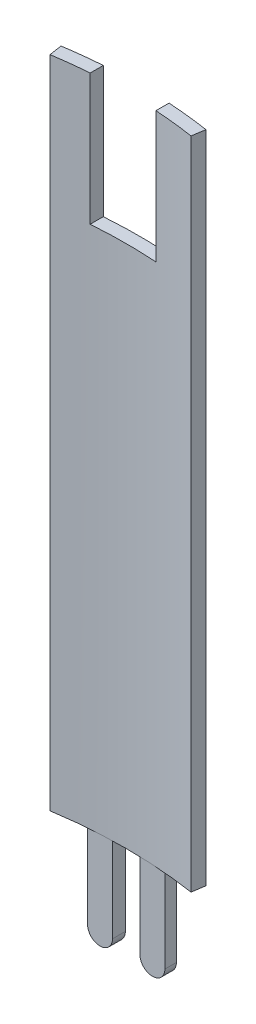
ISO-10303-21;
HEADER;
FILE_DESCRIPTION(('STEP AP214'),'2;1');
FILE_NAME('part.step','',(''),(''),'','','');
FILE_SCHEMA(('AUTOMOTIVE_DESIGN { 1 0 10303 214 1 1 1 1 }'));
ENDSEC;
DATA;
#1=APPLICATION_CONTEXT('core data for automotive mechanical design processes');
#2=APPLICATION_PROTOCOL_DEFINITION('international standard','automotive_design',2000,#1);
#3=PRODUCT_CONTEXT('',#1,'mechanical');
#4=PRODUCT('Part','Part','',(#3));
#5=PRODUCT_RELATED_PRODUCT_CATEGORY('part','',(#4));
#6=PRODUCT_DEFINITION_FORMATION('','',#4);
#7=PRODUCT_DEFINITION_CONTEXT('part definition',#1,'design');
#8=PRODUCT_DEFINITION('design','',#6,#7);
#9=PRODUCT_DEFINITION_SHAPE('','',#8);
#10=(LENGTH_UNIT() NAMED_UNIT(*) SI_UNIT(.MILLI.,.METRE.));
#11=(NAMED_UNIT(*) PLANE_ANGLE_UNIT() SI_UNIT($,.RADIAN.));
#12=(NAMED_UNIT(*) SI_UNIT($,.STERADIAN.) SOLID_ANGLE_UNIT());
#13=UNCERTAINTY_MEASURE_WITH_UNIT(LENGTH_MEASURE(1.E-05),#10,'distance_accuracy_value','');
#14=(GEOMETRIC_REPRESENTATION_CONTEXT(3) GLOBAL_UNCERTAINTY_ASSIGNED_CONTEXT((#13)) GLOBAL_UNIT_ASSIGNED_CONTEXT((#10,
#11,#12)) REPRESENTATION_CONTEXT('',''));
#15=CARTESIAN_POINT('',(0.,0.,0.));
#16=DIRECTION('',(0.,0.,1.));
#17=DIRECTION('',(1.,0.,0.));
#18=AXIS2_PLACEMENT_3D('',#15,#16,#17);
#19=CARTESIAN_POINT('',(0.,127.,0.));
#20=DIRECTION('',(0.,-1.,0.));
#21=DIRECTION('',(0.,0.,-1.));
#22=AXIS2_PLACEMENT_3D('',#19,#20,#21);
#23=PLANE('',#22);
#24=CARTESIAN_POINT('',(0.,127.,0.));
#25=DIRECTION('',(0.,-1.,0.));
#26=DIRECTION('',(0.,0.,-1.));
#27=AXIS2_PLACEMENT_3D('',#24,#25,#26);
#28=CIRCLE('',#27,89.535);
#29=CARTESIAN_POINT('',(-13.716,127.,-88.4781756649627));
#30=VERTEX_POINT('',#29);
#31=CARTESIAN_POINT('',(-6.73910638297873,127.,-89.2810207723842));
#32=VERTEX_POINT('',#31);
#33=EDGE_CURVE('E257',#30,#32,#28,.T.);
#34=ORIENTED_EDGE('',*,*,#33,.T.);
#35=DIRECTION('',(0.,0.,1.));
#36=VECTOR('',#35,1.);
#37=CARTESIAN_POINT('',(-6.73910638297873,127.,-92.076));
#38=LINE('',#37,#36);
#39=CARTESIAN_POINT('',(-6.73910638297873,127.,-91.8280462068038));
#40=VERTEX_POINT('',#39);
#41=EDGE_CURVE('E181',#40,#32,#38,.T.);
#42=ORIENTED_EDGE('',*,*,#41,.F.);
#43=CARTESIAN_POINT('',(0.,127.,0.));
#44=DIRECTION('',(0.,1.,0.));
#45=DIRECTION('',(0.,0.,-1.));
#46=AXIS2_PLACEMENT_3D('',#43,#44,#45);
#47=CIRCLE('',#46,92.075);
#48=CARTESIAN_POINT('',(-14.1051063829787,127.,-90.9881948327631));
#49=VERTEX_POINT('',#48);
#50=EDGE_CURVE('E378',#40,#49,#47,.T.);
#51=ORIENTED_EDGE('',*,*,#50,.T.);
#52=DIRECTION('',(0.153191489361703,0.,0.988196522756047));
#53=VECTOR('',#52,1.);
#54=CARTESIAN_POINT('',(-14.1051063829787,127.,-90.9881948327631));
#55=LINE('',#54,#53);
#56=EDGE_CURVE('E319',#49,#30,#55,.T.);
#57=ORIENTED_EDGE('',*,*,#56,.T.);
#58=EDGE_LOOP('',(#34,#42,#51,#57));
#59=FACE_BOUND('',#58,.T.);
#60=ADVANCED_FACE('F41',(#59),#23,.F.);
#61=CARTESIAN_POINT('',(0.,0.,0.));
#62=DIRECTION('',(0.,-1.,0.));
#63=DIRECTION('',(0.,0.,-1.));
#64=AXIS2_PLACEMENT_3D('',#61,#62,#63);
#65=PLANE('',#64);
#66=CARTESIAN_POINT('',(0.,0.,0.));
#67=DIRECTION('',(0.,1.,0.));
#68=DIRECTION('',(0.,0.,-1.));
#69=AXIS2_PLACEMENT_3D('',#66,#67,#68);
#70=CIRCLE('',#69,92.075);
#71=CARTESIAN_POINT('',(-7.493,0.,-91.7696059488107));
#72=VERTEX_POINT('',#71);
#73=CARTESIAN_POINT('',(-14.1051063829787,0.,-90.9881948327631));
#74=VERTEX_POINT('',#73);
#75=EDGE_CURVE('E287',#72,#74,#70,.T.);
#76=ORIENTED_EDGE('',*,*,#75,.F.);
#77=DIRECTION('',(0.,0.,1.));
#78=VECTOR('',#77,1.);
#79=CARTESIAN_POINT('',(-7.493,0.,0.));
#80=LINE('',#79,#78);
#81=CARTESIAN_POINT('',(-7.493,0.,-89.535));
#82=VERTEX_POINT('',#81);
#83=EDGE_CURVE('E289',#72,#82,#80,.T.);
#84=ORIENTED_EDGE('',*,*,#83,.T.);
#85=DIRECTION('',(-1.,0.,0.));
#86=VECTOR('',#85,1.);
#87=CARTESIAN_POINT('',(0.,0.,-89.535));
#88=LINE('',#87,#86);
#89=CARTESIAN_POINT('',(-2.667,0.,-89.535));
#90=VERTEX_POINT('',#89);
#91=EDGE_CURVE('E11',#90,#82,#88,.T.);
#92=ORIENTED_EDGE('',*,*,#91,.F.);
#93=DIRECTION('',(0.,0.,1.));
#94=VECTOR('',#93,1.);
#95=CARTESIAN_POINT('',(-2.667,0.,0.));
#96=LINE('',#95,#94);
#97=CARTESIAN_POINT('',(-2.667,0.,-92.0363663776444));
#98=VERTEX_POINT('',#97);
#99=EDGE_CURVE('E229',#98,#90,#96,.T.);
#100=ORIENTED_EDGE('',*,*,#99,.F.);
#101=CARTESIAN_POINT('',(2.667,0.,-92.0363663776444));
#102=VERTEX_POINT('',#101);
#103=EDGE_CURVE('E295',#102,#98,#70,.T.);
#104=ORIENTED_EDGE('',*,*,#103,.F.);
#105=DIRECTION('',(0.,0.,1.));
#106=VECTOR('',#105,1.);
#107=CARTESIAN_POINT('',(2.667,0.,0.));
#108=LINE('',#107,#106);
#109=CARTESIAN_POINT('',(2.667,0.,-89.535));
#110=VERTEX_POINT('',#109);
#111=EDGE_CURVE('E50',#102,#110,#108,.T.);
#112=ORIENTED_EDGE('',*,*,#111,.T.);
#113=DIRECTION('',(-1.,0.,0.));
#114=VECTOR('',#113,1.);
#115=CARTESIAN_POINT('',(0.,0.,-89.535));
#116=LINE('',#115,#114);
#117=CARTESIAN_POINT('',(7.493,0.,-89.535));
#118=VERTEX_POINT('',#117);
#119=EDGE_CURVE('E329',#118,#110,#116,.T.);
#120=ORIENTED_EDGE('',*,*,#119,.F.);
#121=DIRECTION('',(0.,0.,1.));
#122=VECTOR('',#121,1.);
#123=CARTESIAN_POINT('',(7.493,0.,0.));
#124=LINE('',#123,#122);
#125=CARTESIAN_POINT('',(7.493,0.,-91.7696059488107));
#126=VERTEX_POINT('',#125);
#127=EDGE_CURVE('E332',#126,#118,#124,.T.);
#128=ORIENTED_EDGE('',*,*,#127,.F.);
#129=CARTESIAN_POINT('',(13.9948928090783,0.,-91.0052119400994));
#130=VERTEX_POINT('',#129);
#131=EDGE_CURVE('E298',#130,#126,#70,.T.);
#132=ORIENTED_EDGE('',*,*,#131,.F.);
#133=DIRECTION('',(0.151994491545787,0.,-0.988381340647292));
#134=VECTOR('',#133,1.);
#135=CARTESIAN_POINT('',(13.608826800552,0.,-88.4947233348553));
#136=LINE('',#135,#134);
#137=CARTESIAN_POINT('',(13.608826800552,0.,-88.4947233348553));
#138=VERTEX_POINT('',#137);
#139=EDGE_CURVE('E296',#138,#130,#136,.T.);
#140=ORIENTED_EDGE('',*,*,#139,.F.);
#141=CARTESIAN_POINT('',(0.,0.,0.));
#142=DIRECTION('',(0.,-1.,0.));
#143=DIRECTION('',(0.,0.,-1.));
#144=AXIS2_PLACEMENT_3D('',#141,#142,#143);
#145=CIRCLE('',#144,89.535);
#146=CARTESIAN_POINT('',(-13.716,0.,-88.4781756649627));
#147=VERTEX_POINT('',#146);
#148=EDGE_CURVE('E253',#147,#138,#145,.T.);
#149=ORIENTED_EDGE('',*,*,#148,.F.);
#150=DIRECTION('',(0.153191489361703,0.,0.988196522756047));
#151=VECTOR('',#150,1.);
#152=CARTESIAN_POINT('',(-14.1051063829787,0.,-90.9881948327631));
#153=LINE('',#152,#151);
#154=EDGE_CURVE('E291',#74,#147,#153,.T.);
#155=ORIENTED_EDGE('',*,*,#154,.F.);
#156=EDGE_LOOP('',(#76,#84,#92,#100,#104,#112,#120,#128,#132,#140,#149,#155));
#157=FACE_BOUND('',#156,.T.);
#158=ADVANCED_FACE('F275',(#157),#65,.T.);
#159=CARTESIAN_POINT('',(0.,127.,0.));
#160=DIRECTION('',(0.,-1.,0.));
#161=DIRECTION('',(0.,0.,-1.));
#162=AXIS2_PLACEMENT_3D('',#159,#160,#161);
#163=CYLINDRICAL_SURFACE('',#162,89.535);
#164=CARTESIAN_POINT('',(0.,101.6,0.));
#165=DIRECTION('',(0.,-1.,0.));
#166=DIRECTION('',(0.,0.,-1.));
#167=AXIS2_PLACEMENT_3D('',#164,#165,#166);
#168=CIRCLE('',#167,89.535);
#169=CARTESIAN_POINT('',(5.96089361702128,101.6,-89.3363530276816));
#170=VERTEX_POINT('',#169);
#171=CARTESIAN_POINT('',(-6.73910638297872,101.6,-89.2810207723842));
#172=VERTEX_POINT('',#171);
#173=EDGE_CURVE('E162',#170,#172,#168,.F.);
#174=ORIENTED_EDGE('',*,*,#173,.T.);
#175=DIRECTION('',(0.,-1.,0.));
#176=VECTOR('',#175,1.);
#177=CARTESIAN_POINT('',(-6.73910638297873,127.,-89.2810207723842));
#178=LINE('',#177,#176);
#179=EDGE_CURVE('E191',#172,#32,#178,.F.);
#180=ORIENTED_EDGE('',*,*,#179,.T.);
#181=ORIENTED_EDGE('',*,*,#33,.F.);
#182=DIRECTION('',(0.,-1.,0.));
#183=VECTOR('',#182,1.);
#184=CARTESIAN_POINT('',(-13.716,127.,-88.4781756649627));
#185=LINE('',#184,#183);
#186=EDGE_CURVE('E315',#30,#147,#185,.T.);
#187=ORIENTED_EDGE('',*,*,#186,.T.);
#188=ORIENTED_EDGE('',*,*,#148,.T.);
#189=DIRECTION('',(0.,-1.,0.));
#190=VECTOR('',#189,1.);
#191=CARTESIAN_POINT('',(13.608826800552,127.,-88.4947233348553));
#192=LINE('',#191,#190);
#193=CARTESIAN_POINT('',(13.608826800552,127.,-88.4947233348553));
#194=VERTEX_POINT('',#193);
#195=EDGE_CURVE('E325',#194,#138,#192,.T.);
#196=ORIENTED_EDGE('',*,*,#195,.F.);
#197=CARTESIAN_POINT('',(5.96089361702127,127.,-89.3363530276816));
#198=VERTEX_POINT('',#197);
#199=EDGE_CURVE('E309',#198,#194,#28,.T.);
#200=ORIENTED_EDGE('',*,*,#199,.F.);
#201=DIRECTION('',(0.,-1.,0.));
#202=VECTOR('',#201,1.);
#203=CARTESIAN_POINT('',(5.96089361702127,127.,-89.3363530276816));
#204=LINE('',#203,#202);
#205=EDGE_CURVE('E57',#198,#170,#204,.T.);
#206=ORIENTED_EDGE('',*,*,#205,.T.);
#207=EDGE_LOOP('',(#174,#180,#181,#187,#188,#196,#200,#206));
#208=FACE_BOUND('',#207,.T.);
#209=ADVANCED_FACE('F43',(#208),#163,.F.);
#210=CARTESIAN_POINT('',(13.608826800552,127.,-88.4947233348553));
#211=DIRECTION('',(-0.988381340647292,0.,-0.151994491545787));
#212=DIRECTION('',(-0.151994491545787,0.,0.988381340647292));
#213=AXIS2_PLACEMENT_3D('',#210,#211,#212);
#214=PLANE('',#213);
#215=ORIENTED_EDGE('',*,*,#139,.T.);
#216=DIRECTION('',(0.,-1.,0.));
#217=VECTOR('',#216,1.);
#218=CARTESIAN_POINT('',(13.9948928090783,127.,-91.0052119400994));
#219=LINE('',#218,#217);
#220=CARTESIAN_POINT('',(13.9948928090783,127.,-91.0052119400994));
#221=VERTEX_POINT('',#220);
#222=EDGE_CURVE('E322',#221,#130,#219,.T.);
#223=ORIENTED_EDGE('',*,*,#222,.F.);
#224=DIRECTION('',(0.151994491545787,0.,-0.988381340647292));
#225=VECTOR('',#224,1.);
#226=CARTESIAN_POINT('',(13.608826800552,127.,-88.4947233348553));
#227=LINE('',#226,#225);
#228=EDGE_CURVE('E379',#194,#221,#227,.T.);
#229=ORIENTED_EDGE('',*,*,#228,.F.);
#230=ORIENTED_EDGE('',*,*,#195,.T.);
#231=EDGE_LOOP('',(#215,#223,#229,#230));
#232=FACE_BOUND('',#231,.T.);
#233=ADVANCED_FACE('F239',(#232),#214,.F.);
#234=CARTESIAN_POINT('',(0.,127.,0.));
#235=DIRECTION('',(0.,-1.,0.));
#236=DIRECTION('',(0.,0.,-1.));
#237=AXIS2_PLACEMENT_3D('',#234,#235,#236);
#238=CYLINDRICAL_SURFACE('',#237,92.075);
#239=ORIENTED_EDGE('',*,*,#50,.F.);
#240=DIRECTION('',(0.,-1.,0.));
#241=VECTOR('',#240,1.);
#242=CARTESIAN_POINT('',(-6.73910638297873,127.,-91.8280462068038));
#243=LINE('',#242,#241);
#244=CARTESIAN_POINT('',(-6.73910638297872,101.6,-91.8280462068038));
#245=VERTEX_POINT('',#244);
#246=EDGE_CURVE('E172',#245,#40,#243,.F.);
#247=ORIENTED_EDGE('',*,*,#246,.F.);
#248=CARTESIAN_POINT('',(0.,101.6,0.));
#249=DIRECTION('',(0.,-1.,0.));
#250=DIRECTION('',(0.,0.,-1.));
#251=AXIS2_PLACEMENT_3D('',#248,#249,#250);
#252=CIRCLE('',#251,92.075);
#253=CARTESIAN_POINT('',(5.96089361702128,101.6,-91.8818446282319));
#254=VERTEX_POINT('',#253);
#255=EDGE_CURVE('E159',#254,#245,#252,.F.);
#256=ORIENTED_EDGE('',*,*,#255,.F.);
#257=DIRECTION('',(0.,-1.,0.));
#258=VECTOR('',#257,1.);
#259=CARTESIAN_POINT('',(5.96089361702127,127.,-91.8818446282319));
#260=LINE('',#259,#258);
#261=CARTESIAN_POINT('',(5.96089361702127,127.,-91.8818446282319));
#262=VERTEX_POINT('',#261);
#263=EDGE_CURVE('E167',#262,#254,#260,.T.);
#264=ORIENTED_EDGE('',*,*,#263,.F.);
#265=EDGE_CURVE('E376',#221,#262,#47,.T.);
#266=ORIENTED_EDGE('',*,*,#265,.F.);
#267=ORIENTED_EDGE('',*,*,#222,.T.);
#268=ORIENTED_EDGE('',*,*,#131,.T.);
#269=DIRECTION('',(0.,-1.,0.));
#270=VECTOR('',#269,1.);
#271=CARTESIAN_POINT('',(7.493,127.,-91.7696059488107));
#272=LINE('',#271,#270);
#273=CARTESIAN_POINT('',(7.493,-16.51,-91.7696059488107));
#274=VERTEX_POINT('',#273);
#275=EDGE_CURVE('E362',#126,#274,#272,.T.);
#276=ORIENTED_EDGE('',*,*,#275,.T.);
#277=CARTESIAN_POINT('',(7.493,-16.51,-91.7696059488107));
#278=CARTESIAN_POINT('',(7.493006626087,-16.5777194077645,-91.7696048483513));
#279=CARTESIAN_POINT('',(7.49014927407407,-16.6454356351868,-91.7698386963676));
#280=CARTESIAN_POINT('',(7.47875787983781,-16.7803820405891,-91.7707680331105));
#281=CARTESIAN_POINT('',(7.47022415768392,-16.8476122457581,-91.7714634958083));
#282=CARTESIAN_POINT('',(7.44754050720196,-16.9810603683064,-91.7733070573561));
#283=CARTESIAN_POINT('',(7.43339515254981,-17.0472790645688,-91.7744547875872));
#284=CARTESIAN_POINT('',(7.39960491193208,-17.178269108345,-91.7771853823897));
#285=CARTESIAN_POINT('',(7.37996008345849,-17.2430404709816,-91.7787682424123));
#286=CARTESIAN_POINT('',(7.31294129536759,-17.4345518806893,-91.784141093818));
#287=CARTESIAN_POINT('',(7.25747239249048,-17.5585514888927,-91.7885562388867));
#288=CARTESIAN_POINT('',(7.12662935629455,-17.7953809024635,-91.7988074798835));
#289=CARTESIAN_POINT('',(7.05125844603452,-17.9082125123841,-91.8046433457189));
#290=CARTESIAN_POINT('',(6.88258527286787,-18.1198399472454,-91.8174427419071));
#291=CARTESIAN_POINT('',(6.78925202100043,-18.2186109947555,-91.8244082177677));
#292=CARTESIAN_POINT('',(6.58737868147916,-18.3991053539727,-91.8391108899842));
#293=CARTESIAN_POINT('',(6.4788361218364,-18.4808258890526,-91.8468482117302));
#294=CARTESIAN_POINT('',(6.24929608540061,-18.6251223605761,-91.8627518381968));
#295=CARTESIAN_POINT('',(6.12826471861179,-18.6876442711509,-91.8709192790857));
#296=CARTESIAN_POINT('',(5.87743122455931,-18.7914680267553,-91.8873071079984));
#297=CARTESIAN_POINT('',(5.74762957508855,-18.832771026709,-91.8955274931158));
#298=CARTESIAN_POINT('',(5.48273898699338,-18.8930325362186,-91.9117120867327));
#299=CARTESIAN_POINT('',(5.34764320606436,-18.9119610735932,-91.9196759377353));
#300=CARTESIAN_POINT('',(5.07615879734381,-18.9268234726386,-91.9350679548108));
#301=CARTESIAN_POINT('',(4.93977014273605,-18.9227568563075,-91.942496109745));
#302=CARTESIAN_POINT('',(4.66966697807484,-18.891735455009,-91.9566099735144));
#303=CARTESIAN_POINT('',(4.53595086535947,-18.8647948359517,-91.9632961389679));
#304=CARTESIAN_POINT('',(4.2749184303451,-18.7887915010812,-91.9757999832422));
#305=CARTESIAN_POINT('',(4.14760203742124,-18.739729029456,-91.9816176716484));
#306=CARTESIAN_POINT('',(3.90318453705352,-18.6209500376191,-91.9923134585833));
#307=CARTESIAN_POINT('',(3.78606891963194,-18.5512634960593,-91.9971929040522));
#308=CARTESIAN_POINT('',(3.56519650648896,-18.3931837380927,-92.0060173849214));
#309=CARTESIAN_POINT('',(3.46143897553128,-18.3047915519633,-92.0099624717594));
#310=CARTESIAN_POINT('',(3.27036743259797,-18.111936980488,-92.0169520881501));
#311=CARTESIAN_POINT('',(3.1830320123195,-18.0074958445106,-92.0199977931593));
#312=CARTESIAN_POINT('',(3.027101383151,-17.7853780806475,-92.0252595302107));
#313=CARTESIAN_POINT('',(2.95851203914186,-17.6676973268446,-92.027475302681));
#314=CARTESIAN_POINT('',(2.84206447972634,-17.4224966046678,-92.031145283399));
#315=CARTESIAN_POINT('',(2.79420758708716,-17.2949760091058,-92.0325994430556));
#316=CARTESIAN_POINT('',(2.72064768126196,-17.0338045538002,-92.0348036230974));
#317=CARTESIAN_POINT('',(2.6949109985892,-16.9001633381246,-92.0355547137898));
#318=CARTESIAN_POINT('',(2.67603970066728,-16.7230229230481,-92.0361040167294));
#319=CARTESIAN_POINT('',(2.67264802910479,-16.6804514388047,-92.0362025469646));
#320=CARTESIAN_POINT('',(2.66813127052844,-16.5952590711743,-92.0363336350541));
#321=CARTESIAN_POINT('',(2.66700243186611,-16.5526383869701,-92.0363663021063));
#322=CARTESIAN_POINT('',(2.667,-16.51,-92.0363663776444));
#323=B_SPLINE_CURVE_WITH_KNOTS('',3,(#277,#278,#279,#280,#281,#282,#283,#284,#285,#286,#287,
#288,#289,#290,#291,#292,#293,#294,#295,#296,#297,#298,#299,#300,#301,#302,#303,#304,#305,#306,
#307,#308,#309,#310,#311,#312,#313,#314,#315,#316,#317,#318,#319,#320,#321,#322),.UNSPECIFIED.,
.F.,.F.,(4,2,2,2,2,2,2,2,2,2,2,2,2,2,2,2,2,2,2,2,2,2,4),(0.,0.203091848510125,0.406172246395432,
0.609087465619882,0.812000563628926,1.21763970045303,1.6232131857185,2.02949274988816,
2.43583842397188,2.84331731152253,3.25077401805689,3.65877592544837,4.06678631403418,
4.47454420522019,4.88229759555853,5.28946117230441,5.69660232895769,6.10320898890269,
6.5099427142072,6.916702386025,7.32284182109663,7.4509191526884,7.5787839631257),.UNSPECIFIED.);
#324=CARTESIAN_POINT('',(2.667,-16.51,-92.0363663776444));
#325=VERTEX_POINT('',#324);
#326=EDGE_CURVE('E243',#274,#325,#323,.T.);
#327=ORIENTED_EDGE('',*,*,#326,.T.);
#328=DIRECTION('',(0.,-1.,0.));
#329=VECTOR('',#328,1.);
#330=CARTESIAN_POINT('',(2.667,127.,-92.0363663776444));
#331=LINE('',#330,#329);
#332=EDGE_CURVE('E254',#102,#325,#331,.T.);
#333=ORIENTED_EDGE('',*,*,#332,.F.);
#334=ORIENTED_EDGE('',*,*,#103,.T.);
#335=DIRECTION('',(0.,-1.,0.));
#336=VECTOR('',#335,1.);
#337=CARTESIAN_POINT('',(-2.667,127.,-92.0363663776444));
#338=LINE('',#337,#336);
#339=CARTESIAN_POINT('',(-2.667,-16.51,-92.0363663776444));
#340=VERTEX_POINT('',#339);
#341=EDGE_CURVE('E198',#98,#340,#338,.T.);
#342=ORIENTED_EDGE('',*,*,#341,.T.);
#343=CARTESIAN_POINT('',(-2.667,-16.51,-92.0363663776444));
#344=CARTESIAN_POINT('',(-2.66700043694204,-16.5778606015086,-92.0363659326404));
#345=CARTESIAN_POINT('',(-2.66986445456633,-16.6456886900262,-92.0362834210329));
#346=CARTESIAN_POINT('',(-2.68129009461142,-16.7808594985672,-92.0359514352847));
#347=CARTESIAN_POINT('',(-2.68985144348247,-16.8482022417368,-92.03570196916));
#348=CARTESIAN_POINT('',(-2.72400109796113,-17.0486676949472,-92.0346999539349));
#349=CARTESIAN_POINT('',(-2.75805523016527,-17.1804474835837,-92.0336938038246));
#350=CARTESIAN_POINT('',(-2.84779065836427,-17.4364107933588,-92.0309605756936));
#351=CARTESIAN_POINT('',(-2.90348198277703,-17.5605907611912,-92.0292331633542));
#352=CARTESIAN_POINT('',(-3.03489843881721,-17.7978283929101,-92.0249929176764));
#353=CARTESIAN_POINT('',(-3.11061962616582,-17.9108882405631,-92.0224802389549));
#354=CARTESIAN_POINT('',(-3.27994918373003,-18.1226917739373,-92.016600203984));
#355=CARTESIAN_POINT('',(-3.3735589415664,-18.2214343480184,-92.0132327814253));
#356=CARTESIAN_POINT('',(-3.57601122013808,-18.4018164416749,-92.0055868391844));
#357=CARTESIAN_POINT('',(-3.68485606328843,-18.4834533489399,-92.0013081805427));
#358=CARTESIAN_POINT('',(-3.91470261853552,-18.6273187368762,-91.9918145382985));
#359=CARTESIAN_POINT('',(-4.03570798085687,-18.6895413668169,-91.9865992731828));
#360=CARTESIAN_POINT('',(-4.28639701776899,-18.7927918753307,-91.9752583723601));
#361=CARTESIAN_POINT('',(-4.41608017136307,-18.8338210250292,-91.9691327912797));
#362=CARTESIAN_POINT('',(-4.68057576121469,-18.8935747954621,-91.9560513212868));
#363=CARTESIAN_POINT('',(-4.81539293726797,-18.9122782631256,-91.9490946517898));
#364=CARTESIAN_POINT('',(-5.08622130194173,-18.9267997398398,-91.9345112935414));
#365=CARTESIAN_POINT('',(-5.22223252865418,-18.9226170161194,-91.9268845833441));
#366=CARTESIAN_POINT('',(-5.49179599092864,-18.8914760616109,-91.9111748410668));
#367=CARTESIAN_POINT('',(-5.62534437372841,-18.8644848050685,-91.9030911631633));
#368=CARTESIAN_POINT('',(-5.88600089677841,-18.7884561572019,-91.886765548422));
#369=CARTESIAN_POINT('',(-6.01310899990108,-18.7394186387993,-91.8785236106724));
#370=CARTESIAN_POINT('',(-6.25743134213622,-18.6206154035347,-91.8622076923596));
#371=CARTESIAN_POINT('',(-6.37463411351436,-18.5508260726021,-91.8541339144105));
#372=CARTESIAN_POINT('',(-6.59565060693155,-18.3925112555076,-91.8385284711173));
#373=CARTESIAN_POINT('',(-6.69946498470362,-18.3039866875161,-91.8309967792309));
#374=CARTESIAN_POINT('',(-6.89069055633781,-18.1107605740226,-91.8168460405136));
#375=CARTESIAN_POINT('',(-6.9781122249171,-18.0060694372715,-91.8102264116092));
#376=CARTESIAN_POINT('',(-7.13415371874799,-17.7833835608196,-91.7982332245147));
#377=CARTESIAN_POINT('',(-7.20276778280381,-17.6653847602678,-91.7928600482187));
#378=CARTESIAN_POINT('',(-7.31906827224669,-17.419721105471,-91.7836601757739));
#379=CARTESIAN_POINT('',(-7.36679234611396,-17.2920741305482,-91.7798306985244));
#380=CARTESIAN_POINT('',(-7.44005700298827,-17.0306412158125,-91.773920863543));
#381=CARTESIAN_POINT('',(-7.46563208312264,-16.8968651655102,-91.7718377859503));
#382=CARTESIAN_POINT('',(-7.48420160098612,-16.7201658397177,-91.7703239430663));
#383=CARTESIAN_POINT('',(-7.48750270600989,-16.6781642030915,-91.770054645415));
#384=CARTESIAN_POINT('',(-7.49189888531849,-16.5941140654868,-91.7696958937344));
#385=CARTESIAN_POINT('',(-7.49299757818907,-16.5520657551396,-91.7696061447054));
#386=CARTESIAN_POINT('',(-7.493,-16.51,-91.7696059488107));
#387=B_SPLINE_CURVE_WITH_KNOTS('',3,(#343,#344,#345,#346,#347,#348,#349,#350,#351,#352,#353,
#354,#355,#356,#357,#358,#359,#360,#361,#362,#363,#364,#365,#366,#367,#368,#369,#370,#371,#372,
#373,#374,#375,#376,#377,#378,#379,#380,#381,#382,#383,#384,#385,#386),.UNSPECIFIED.,.F.,.F.,(4,
2,2,2,2,2,2,2,2,2,2,2,2,2,2,2,2,2,2,2,2,4),(0.,0.203456754574245,0.406903741149407,
0.813146544829442,1.21957785919627,1.62592919864905,2.03231207167861,2.43875696074689,
2.84532421892053,3.25186708949697,3.65879484512989,4.06573562986887,4.47326665864807,
4.88080003653577,5.28879894446507,5.69677786194179,6.10449519142032,6.51233727474483,
6.91944127748397,7.32591006822589,7.45226578648809,7.57841373028967),.UNSPECIFIED.);
#388=CARTESIAN_POINT('',(-7.493,-16.51,-91.7696059488107));
#389=VERTEX_POINT('',#388);
#390=EDGE_CURVE('E204',#340,#389,#387,.T.);
#391=ORIENTED_EDGE('',*,*,#390,.T.);
#392=DIRECTION('',(0.,-1.,0.));
#393=VECTOR('',#392,1.);
#394=CARTESIAN_POINT('',(-7.493,127.,-91.7696059488107));
#395=LINE('',#394,#393);
#396=EDGE_CURVE('E65',#72,#389,#395,.T.);
#397=ORIENTED_EDGE('',*,*,#396,.F.);
#398=ORIENTED_EDGE('',*,*,#75,.T.);
#399=DIRECTION('',(0.,-1.,0.));
#400=VECTOR('',#399,1.);
#401=CARTESIAN_POINT('',(-14.1051063829787,127.,-90.9881948327631));
#402=LINE('',#401,#400);
#403=EDGE_CURVE('E318',#49,#74,#402,.T.);
#404=ORIENTED_EDGE('',*,*,#403,.F.);
#405=EDGE_LOOP('',(#239,#247,#256,#264,#266,#267,#268,#276,#327,#333,#334,#342,#391,#397,#398,#404));
#406=FACE_BOUND('',#405,.T.);
#407=ADVANCED_FACE('F175',(#406),#238,.T.);
#408=CARTESIAN_POINT('',(-14.1051063829787,127.,-90.9881948327631));
#409=DIRECTION('',(0.988196522756047,0.,-0.153191489361703));
#410=DIRECTION('',(-0.153191489361703,0.,-0.988196522756047));
#411=AXIS2_PLACEMENT_3D('',#408,#409,#410);
#412=PLANE('',#411);
#413=ORIENTED_EDGE('',*,*,#154,.T.);
#414=ORIENTED_EDGE('',*,*,#186,.F.);
#415=ORIENTED_EDGE('',*,*,#56,.F.);
#416=ORIENTED_EDGE('',*,*,#403,.T.);
#417=EDGE_LOOP('',(#413,#414,#415,#416));
#418=FACE_BOUND('',#417,.T.);
#419=ADVANCED_FACE('F238',(#418),#412,.F.);
#420=ORIENTED_EDGE('',*,*,#265,.T.);
#421=DIRECTION('',(0.,0.,1.));
#422=VECTOR('',#421,1.);
#423=CARTESIAN_POINT('',(5.96089361702127,127.,-92.076));
#424=LINE('',#423,#422);
#425=EDGE_CURVE('E164',#262,#198,#424,.T.);
#426=ORIENTED_EDGE('',*,*,#425,.T.);
#427=ORIENTED_EDGE('',*,*,#199,.T.);
#428=ORIENTED_EDGE('',*,*,#228,.T.);
#429=EDGE_LOOP('',(#420,#426,#427,#428));
#430=FACE_BOUND('',#429,.T.);
#431=ADVANCED_FACE('F271',(#430),#23,.F.);
#432=CARTESIAN_POINT('',(2.667,0.,-92.076));
#433=DIRECTION('',(1.,0.,0.));
#434=DIRECTION('',(0.,0.,-1.));
#435=AXIS2_PLACEMENT_3D('',#432,#433,#434);
#436=PLANE('',#435);
#437=ORIENTED_EDGE('',*,*,#111,.F.);
#438=ORIENTED_EDGE('',*,*,#332,.T.);
#439=DIRECTION('',(0.,0.,1.));
#440=VECTOR('',#439,1.);
#441=CARTESIAN_POINT('',(2.667,-16.51,-92.076));
#442=LINE('',#441,#440);
#443=CARTESIAN_POINT('',(2.667,-16.51,-89.535));
#444=VERTEX_POINT('',#443);
#445=EDGE_CURVE('E255',#325,#444,#442,.T.);
#446=ORIENTED_EDGE('',*,*,#445,.T.);
#447=DIRECTION('',(0.,1.,0.));
#448=VECTOR('',#447,1.);
#449=CARTESIAN_POINT('',(2.667,0.,-89.535));
#450=LINE('',#449,#448);
#451=EDGE_CURVE('E343',#444,#110,#450,.T.);
#452=ORIENTED_EDGE('',*,*,#451,.T.);
#453=EDGE_LOOP('',(#437,#438,#446,#452));
#454=FACE_BOUND('',#453,.T.);
#455=ADVANCED_FACE('F268',(#454),#436,.F.);
#456=CARTESIAN_POINT('',(7.493,0.,-92.076));
#457=DIRECTION('',(1.,0.,0.));
#458=DIRECTION('',(0.,0.,-1.));
#459=AXIS2_PLACEMENT_3D('',#456,#457,#458);
#460=PLANE('',#459);
#461=ORIENTED_EDGE('',*,*,#275,.F.);
#462=ORIENTED_EDGE('',*,*,#127,.T.);
#463=DIRECTION('',(0.,1.,0.));
#464=VECTOR('',#463,1.);
#465=CARTESIAN_POINT('',(7.493,0.,-89.535));
#466=LINE('',#465,#464);
#467=CARTESIAN_POINT('',(7.493,-16.51,-89.535));
#468=VERTEX_POINT('',#467);
#469=EDGE_CURVE('E353',#468,#118,#466,.T.);
#470=ORIENTED_EDGE('',*,*,#469,.F.);
#471=DIRECTION('',(0.,0.,1.));
#472=VECTOR('',#471,1.);
#473=CARTESIAN_POINT('',(7.493,-16.51,-92.076));
#474=LINE('',#473,#472);
#475=EDGE_CURVE('E360',#274,#468,#474,.T.);
#476=ORIENTED_EDGE('',*,*,#475,.F.);
#477=EDGE_LOOP('',(#461,#462,#470,#476));
#478=FACE_BOUND('',#477,.T.);
#479=ADVANCED_FACE('F265',(#478),#460,.T.);
#480=CARTESIAN_POINT('',(5.08,-16.51,-92.076));
#481=DIRECTION('',(0.,0.,1.));
#482=DIRECTION('',(1.,0.,0.));
#483=AXIS2_PLACEMENT_3D('',#480,#481,#482);
#484=CYLINDRICAL_SURFACE('',#483,2.413);
#485=ORIENTED_EDGE('',*,*,#326,.F.);
#486=ORIENTED_EDGE('',*,*,#475,.T.);
#487=CARTESIAN_POINT('',(5.08,-16.51,-89.535));
#488=DIRECTION('',(0.,0.,1.));
#489=DIRECTION('',(1.,0.,0.));
#490=AXIS2_PLACEMENT_3D('',#487,#488,#489);
#491=CIRCLE('',#490,2.413);
#492=EDGE_CURVE('E349',#444,#468,#491,.T.);
#493=ORIENTED_EDGE('',*,*,#492,.F.);
#494=ORIENTED_EDGE('',*,*,#445,.F.);
#495=EDGE_LOOP('',(#485,#486,#493,#494));
#496=FACE_BOUND('',#495,.T.);
#497=ADVANCED_FACE('F259',(#496),#484,.T.);
#498=CARTESIAN_POINT('',(0.,0.,-89.535));
#499=DIRECTION('',(0.,0.,1.));
#500=DIRECTION('',(1.,0.,0.));
#501=AXIS2_PLACEMENT_3D('',#498,#499,#500);
#502=PLANE('',#501);
#503=ORIENTED_EDGE('',*,*,#469,.T.);
#504=ORIENTED_EDGE('',*,*,#119,.T.);
#505=ORIENTED_EDGE('',*,*,#451,.F.);
#506=ORIENTED_EDGE('',*,*,#492,.T.);
#507=EDGE_LOOP('',(#503,#504,#505,#506));
#508=FACE_BOUND('',#507,.T.);
#509=ADVANCED_FACE('F264',(#508),#502,.T.);
#510=CARTESIAN_POINT('',(-7.493,0.,-92.076));
#511=DIRECTION('',(1.,0.,0.));
#512=DIRECTION('',(0.,0.,-1.));
#513=AXIS2_PLACEMENT_3D('',#510,#511,#512);
#514=PLANE('',#513);
#515=ORIENTED_EDGE('',*,*,#83,.F.);
#516=ORIENTED_EDGE('',*,*,#396,.T.);
#517=DIRECTION('',(0.,0.,1.));
#518=VECTOR('',#517,1.);
#519=CARTESIAN_POINT('',(-7.493,-16.51,-92.076));
#520=LINE('',#519,#518);
#521=CARTESIAN_POINT('',(-7.493,-16.51,-89.535));
#522=VERTEX_POINT('',#521);
#523=EDGE_CURVE('E216',#389,#522,#520,.T.);
#524=ORIENTED_EDGE('',*,*,#523,.T.);
#525=DIRECTION('',(0.,1.,0.));
#526=VECTOR('',#525,1.);
#527=CARTESIAN_POINT('',(-7.493,0.,-89.535));
#528=LINE('',#527,#526);
#529=EDGE_CURVE('E197',#522,#82,#528,.T.);
#530=ORIENTED_EDGE('',*,*,#529,.T.);
#531=EDGE_LOOP('',(#515,#516,#524,#530));
#532=FACE_BOUND('',#531,.T.);
#533=ADVANCED_FACE('F405',(#532),#514,.F.);
#534=CARTESIAN_POINT('',(-2.667,0.,-92.076));
#535=DIRECTION('',(1.,0.,0.));
#536=DIRECTION('',(0.,0.,-1.));
#537=AXIS2_PLACEMENT_3D('',#534,#535,#536);
#538=PLANE('',#537);
#539=ORIENTED_EDGE('',*,*,#341,.F.);
#540=ORIENTED_EDGE('',*,*,#99,.T.);
#541=DIRECTION('',(0.,1.,0.));
#542=VECTOR('',#541,1.);
#543=CARTESIAN_POINT('',(-2.667,0.,-89.535));
#544=LINE('',#543,#542);
#545=CARTESIAN_POINT('',(-2.667,-16.51,-89.535));
#546=VERTEX_POINT('',#545);
#547=EDGE_CURVE('E212',#546,#90,#544,.T.);
#548=ORIENTED_EDGE('',*,*,#547,.F.);
#549=DIRECTION('',(0.,0.,1.));
#550=VECTOR('',#549,1.);
#551=CARTESIAN_POINT('',(-2.667,-16.51,-92.076));
#552=LINE('',#551,#550);
#553=EDGE_CURVE('E201',#340,#546,#552,.T.);
#554=ORIENTED_EDGE('',*,*,#553,.F.);
#555=EDGE_LOOP('',(#539,#540,#548,#554));
#556=FACE_BOUND('',#555,.T.);
#557=ADVANCED_FACE('F403',(#556),#538,.T.);
#558=CARTESIAN_POINT('',(-5.08,-16.51,-92.076));
#559=DIRECTION('',(0.,0.,1.));
#560=DIRECTION('',(1.,0.,0.));
#561=AXIS2_PLACEMENT_3D('',#558,#559,#560);
#562=CYLINDRICAL_SURFACE('',#561,2.413);
#563=ORIENTED_EDGE('',*,*,#390,.F.);
#564=ORIENTED_EDGE('',*,*,#553,.T.);
#565=CARTESIAN_POINT('',(-5.08,-16.51,-89.535));
#566=DIRECTION('',(0.,0.,1.));
#567=DIRECTION('',(1.,0.,0.));
#568=AXIS2_PLACEMENT_3D('',#565,#566,#567);
#569=CIRCLE('',#568,2.413);
#570=EDGE_CURVE('E208',#522,#546,#569,.T.);
#571=ORIENTED_EDGE('',*,*,#570,.F.);
#572=ORIENTED_EDGE('',*,*,#523,.F.);
#573=EDGE_LOOP('',(#563,#564,#571,#572));
#574=FACE_BOUND('',#573,.T.);
#575=ADVANCED_FACE('F231',(#574),#562,.T.);
#576=CARTESIAN_POINT('',(0.,0.,-89.535));
#577=DIRECTION('',(0.,0.,1.));
#578=DIRECTION('',(1.,0.,0.));
#579=AXIS2_PLACEMENT_3D('',#576,#577,#578);
#580=PLANE('',#579);
#581=ORIENTED_EDGE('',*,*,#547,.T.);
#582=ORIENTED_EDGE('',*,*,#91,.T.);
#583=ORIENTED_EDGE('',*,*,#529,.F.);
#584=ORIENTED_EDGE('',*,*,#570,.T.);
#585=EDGE_LOOP('',(#581,#582,#583,#584));
#586=FACE_BOUND('',#585,.T.);
#587=ADVANCED_FACE('F398',(#586),#580,.T.);
#588=CARTESIAN_POINT('',(5.96089361702128,101.6,-92.076));
#589=DIRECTION('',(0.,-1.,0.));
#590=DIRECTION('',(0.,0.,-1.));
#591=AXIS2_PLACEMENT_3D('',#588,#589,#590);
#592=PLANE('',#591);
#593=DIRECTION('',(0.,0.,1.));
#594=VECTOR('',#593,1.);
#595=CARTESIAN_POINT('',(5.96089361702128,101.6,-92.076));
#596=LINE('',#595,#594);
#597=EDGE_CURVE('E154',#254,#170,#596,.T.);
#598=ORIENTED_EDGE('',*,*,#597,.F.);
#599=ORIENTED_EDGE('',*,*,#255,.T.);
#600=DIRECTION('',(0.,0.,1.));
#601=VECTOR('',#600,1.);
#602=CARTESIAN_POINT('',(-6.73910638297872,101.6,-92.076));
#603=LINE('',#602,#601);
#604=EDGE_CURVE('E184',#245,#172,#603,.T.);
#605=ORIENTED_EDGE('',*,*,#604,.T.);
#606=ORIENTED_EDGE('',*,*,#173,.F.);
#607=EDGE_LOOP('',(#598,#599,#605,#606));
#608=FACE_BOUND('',#607,.T.);
#609=ADVANCED_FACE('F156',(#608),#592,.F.);
#610=CARTESIAN_POINT('',(-6.73910638297873,127.,-92.076));
#611=DIRECTION('',(-1.,0.,0.));
#612=DIRECTION('',(0.,-1.,0.));
#613=AXIS2_PLACEMENT_3D('',#610,#611,#612);
#614=PLANE('',#613);
#615=ORIENTED_EDGE('',*,*,#604,.F.);
#616=ORIENTED_EDGE('',*,*,#246,.T.);
#617=ORIENTED_EDGE('',*,*,#41,.T.);
#618=ORIENTED_EDGE('',*,*,#179,.F.);
#619=EDGE_LOOP('',(#615,#616,#617,#618));
#620=FACE_BOUND('',#619,.T.);
#621=ADVANCED_FACE('F390',(#620),#614,.F.);
#622=CARTESIAN_POINT('',(5.96089361702127,127.,-92.076));
#623=DIRECTION('',(1.,0.,0.));
#624=DIRECTION('',(0.,1.,0.));
#625=AXIS2_PLACEMENT_3D('',#622,#623,#624);
#626=PLANE('',#625);
#627=ORIENTED_EDGE('',*,*,#425,.F.);
#628=ORIENTED_EDGE('',*,*,#263,.T.);
#629=ORIENTED_EDGE('',*,*,#597,.T.);
#630=ORIENTED_EDGE('',*,*,#205,.F.);
#631=EDGE_LOOP('',(#627,#628,#629,#630));
#632=FACE_BOUND('',#631,.T.);
#633=ADVANCED_FACE('F168',(#632),#626,.F.);
#634=CLOSED_SHELL('',(#60,#158,#209,#233,#407,#419,#431,#455,#479,#497,#509,#533,#557,#575,#587,
#609,#621,#633));
#635=MANIFOLD_SOLID_BREP('B2',#634);
#636=ADVANCED_BREP_SHAPE_REPRESENTATION('',(#18,#635),#14);
#637=SHAPE_DEFINITION_REPRESENTATION(#9,#636);
ENDSEC;
END-ISO-10303-21;
